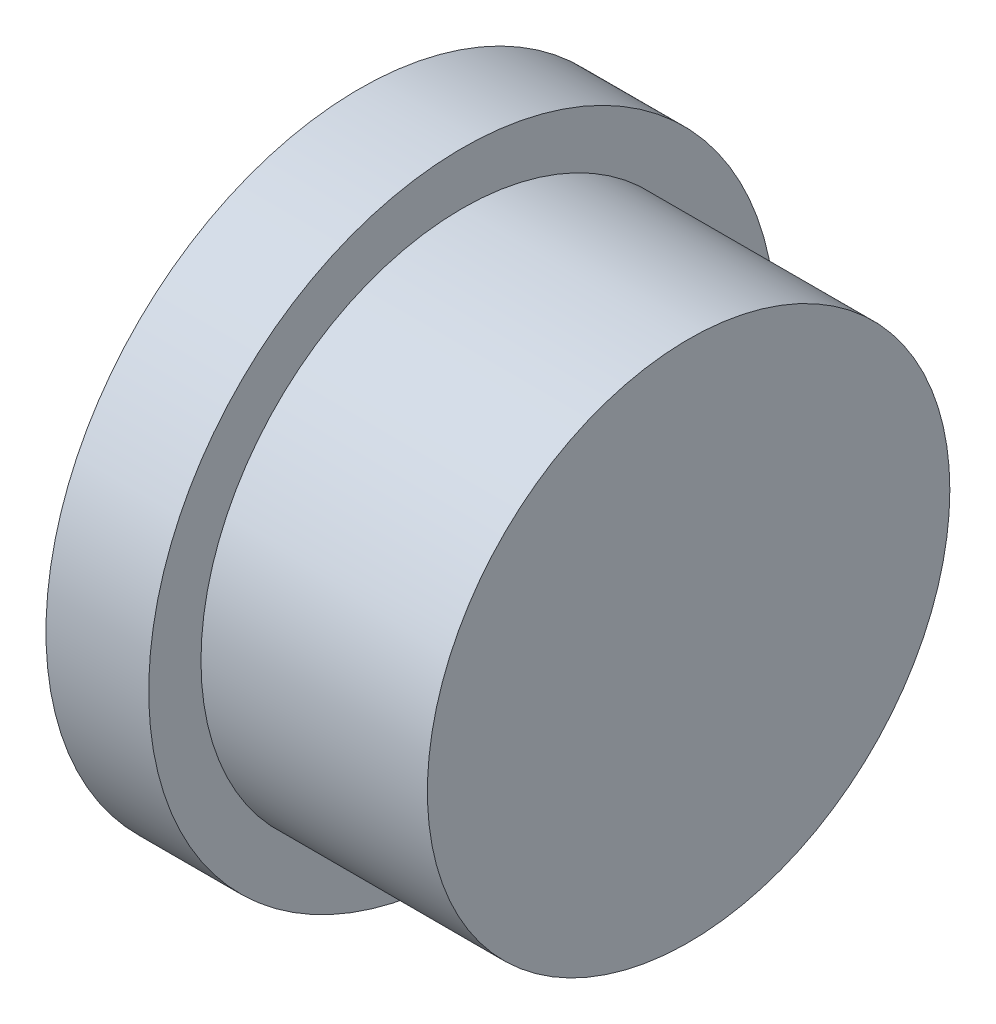
ISO-10303-21;
HEADER;
FILE_DESCRIPTION(('STEP AP214'),'2;1');
FILE_NAME('part.step','',(''),(''),'','','');
FILE_SCHEMA(('AUTOMOTIVE_DESIGN { 1 0 10303 214 1 1 1 1 }'));
ENDSEC;
DATA;
#1=APPLICATION_CONTEXT('core data for automotive mechanical design processes');
#2=APPLICATION_PROTOCOL_DEFINITION('international standard','automotive_design',2000,#1);
#3=PRODUCT_CONTEXT('',#1,'mechanical');
#4=PRODUCT('Part','Part','',(#3));
#5=PRODUCT_RELATED_PRODUCT_CATEGORY('part','',(#4));
#6=PRODUCT_DEFINITION_FORMATION('','',#4);
#7=PRODUCT_DEFINITION_CONTEXT('part definition',#1,'design');
#8=PRODUCT_DEFINITION('design','',#6,#7);
#9=PRODUCT_DEFINITION_SHAPE('','',#8);
#10=(LENGTH_UNIT() NAMED_UNIT(*) SI_UNIT(.MILLI.,.METRE.));
#11=(NAMED_UNIT(*) PLANE_ANGLE_UNIT() SI_UNIT($,.RADIAN.));
#12=(NAMED_UNIT(*) SI_UNIT($,.STERADIAN.) SOLID_ANGLE_UNIT());
#13=UNCERTAINTY_MEASURE_WITH_UNIT(LENGTH_MEASURE(1.E-05),#10,'distance_accuracy_value','');
#14=(GEOMETRIC_REPRESENTATION_CONTEXT(3) GLOBAL_UNCERTAINTY_ASSIGNED_CONTEXT((#13)) GLOBAL_UNIT_ASSIGNED_CONTEXT((#10,
#11,#12)) REPRESENTATION_CONTEXT('',''));
#15=CARTESIAN_POINT('',(0.,0.,0.));
#16=DIRECTION('',(0.,0.,1.));
#17=DIRECTION('',(1.,0.,0.));
#18=AXIS2_PLACEMENT_3D('',#15,#16,#17);
#19=CARTESIAN_POINT('',(22.2992133415162,4.38962310495809,-8.29136190635743));
#20=DIRECTION('',(-1.,0.,0.));
#21=DIRECTION('',(0.,0.,1.));
#22=AXIS2_PLACEMENT_3D('',#19,#20,#21);
#23=PLANE('',#22);
#24=CARTESIAN_POINT('',(22.2992133415162,4.38962310495809,-8.29136190635743));
#25=DIRECTION('',(-1.,0.,0.));
#26=DIRECTION('',(0.,0.,1.));
#27=AXIS2_PLACEMENT_3D('',#24,#25,#26);
#28=CIRCLE('',#27,13.5);
#29=CARTESIAN_POINT('',(22.2992133415162,4.38962310495809,-21.7913619063574));
#30=VERTEX_POINT('',#29);
#31=EDGE_CURVE('E55',#30,#30,#28,.T.);
#32=ORIENTED_EDGE('',*,*,#31,.F.);
#33=EDGE_LOOP('',(#32));
#34=FACE_BOUND('',#33,.T.);
#35=CARTESIAN_POINT('',(22.2992133415162,4.38962310495809,-8.29136190635743));
#36=DIRECTION('',(-1.,0.,0.));
#37=DIRECTION('',(0.,0.,1.));
#38=AXIS2_PLACEMENT_3D('',#35,#36,#37);
#39=CIRCLE('',#38,16.075);
#40=CARTESIAN_POINT('',(22.2992133415162,4.38962310495809,7.78363809364256));
#41=VERTEX_POINT('',#40);
#42=EDGE_CURVE('E62',#41,#41,#39,.T.);
#43=ORIENTED_EDGE('',*,*,#42,.T.);
#44=EDGE_LOOP('',(#43));
#45=FACE_BOUND('',#44,.T.);
#46=ADVANCED_FACE('F32',(#34,#45),#23,.T.);
#47=CARTESIAN_POINT('',(36.1992133415162,4.38962310495809,-8.29136190635743));
#48=DIRECTION('',(1.,0.,0.));
#49=DIRECTION('',(0.,0.,-1.));
#50=AXIS2_PLACEMENT_3D('',#47,#48,#49);
#51=PLANE('',#50);
#52=CARTESIAN_POINT('',(36.1992133415162,4.38962310495809,-8.29136190635743));
#53=DIRECTION('',(1.,0.,0.));
#54=DIRECTION('',(0.,0.,-1.));
#55=AXIS2_PLACEMENT_3D('',#52,#53,#54);
#56=CIRCLE('',#55,2.874);
#57=CARTESIAN_POINT('',(36.1992133415162,4.38962310495809,-11.1653619063574));
#58=VERTEX_POINT('',#57);
#59=EDGE_CURVE('E10',#58,#58,#56,.F.);
#60=ORIENTED_EDGE('',*,*,#59,.F.);
#61=EDGE_LOOP('',(#60));
#62=FACE_BOUND('',#61,.T.);
#63=CARTESIAN_POINT('',(36.1992133415162,4.38962310495809,-8.29136190635743));
#64=DIRECTION('',(1.,0.,0.));
#65=DIRECTION('',(0.,0.,-1.));
#66=AXIS2_PLACEMENT_3D('',#63,#64,#65);
#67=CIRCLE('',#66,13.5);
#68=CARTESIAN_POINT('',(36.1992133415162,4.38962310495809,-21.7913619063574));
#69=VERTEX_POINT('',#68);
#70=EDGE_CURVE('E43',#69,#69,#67,.F.);
#71=ORIENTED_EDGE('',*,*,#70,.T.);
#72=EDGE_LOOP('',(#71));
#73=FACE_BOUND('',#72,.T.);
#74=ADVANCED_FACE('F87',(#62,#73),#51,.F.);
#75=CARTESIAN_POINT('',(24.1992133415162,4.38962310495809,-8.29136190635743));
#76=DIRECTION('',(1.,0.,0.));
#77=DIRECTION('',(0.,0.,-1.));
#78=AXIS2_PLACEMENT_3D('',#75,#76,#77);
#79=CYLINDRICAL_SURFACE('',#78,13.5);
#80=CARTESIAN_POINT('',(36.1992133415162,4.38962310495809,-21.7913619063574));
#81=CARTESIAN_POINT('',(36.0544216748495,4.38962310495809,-21.7913619063574));
#82=CARTESIAN_POINT('',(35.9096300081828,4.38962310495809,-21.7913619063574));
#83=CARTESIAN_POINT('',(35.6200466748495,4.38962310495809,-21.7913619063574));
#84=CARTESIAN_POINT('',(35.4752550081828,4.38962310495809,-21.7913619063574));
#85=CARTESIAN_POINT('',(35.1856716748495,4.38962310495809,-21.7913619063574));
#86=CARTESIAN_POINT('',(35.0408800081828,4.38962310495809,-21.7913619063574));
#87=CARTESIAN_POINT('',(34.7512966748495,4.38962310495809,-21.7913619063574));
#88=CARTESIAN_POINT('',(34.6065050081828,4.38962310495809,-21.7913619063574));
#89=CARTESIAN_POINT('',(34.3169216748495,4.38962310495809,-21.7913619063574));
#90=CARTESIAN_POINT('',(34.1721300081828,4.38962310495809,-21.7913619063574));
#91=CARTESIAN_POINT('',(33.8825466748495,4.38962310495809,-21.7913619063574));
#92=CARTESIAN_POINT('',(33.7377550081828,4.38962310495809,-21.7913619063574));
#93=CARTESIAN_POINT('',(33.4481716748495,4.38962310495809,-21.7913619063574));
#94=CARTESIAN_POINT('',(33.3033800081828,4.38962310495809,-21.7913619063574));
#95=CARTESIAN_POINT('',(33.0137966748495,4.38962310495809,-21.7913619063574));
#96=CARTESIAN_POINT('',(32.8690050081828,4.38962310495809,-21.7913619063574));
#97=CARTESIAN_POINT('',(32.5794216748495,4.38962310495809,-21.7913619063574));
#98=CARTESIAN_POINT('',(32.4346300081828,4.38962310495809,-21.7913619063574));
#99=CARTESIAN_POINT('',(32.1450466748495,4.38962310495809,-21.7913619063574));
#100=CARTESIAN_POINT('',(32.0002550081828,4.38962310495809,-21.7913619063574));
#101=CARTESIAN_POINT('',(31.7106716748495,4.38962310495809,-21.7913619063574));
#102=CARTESIAN_POINT('',(31.5658800081828,4.38962310495809,-21.7913619063574));
#103=CARTESIAN_POINT('',(31.2762966748495,4.38962310495809,-21.7913619063574));
#104=CARTESIAN_POINT('',(31.1315050081828,4.38962310495809,-21.7913619063574));
#105=CARTESIAN_POINT('',(30.8419216748495,4.38962310495809,-21.7913619063574));
#106=CARTESIAN_POINT('',(30.6971300081828,4.38962310495809,-21.7913619063574));
#107=CARTESIAN_POINT('',(30.4075466748495,4.38962310495809,-21.7913619063574));
#108=CARTESIAN_POINT('',(30.2627550081828,4.38962310495809,-21.7913619063574));
#109=CARTESIAN_POINT('',(29.9731716748495,4.38962310495809,-21.7913619063574));
#110=CARTESIAN_POINT('',(29.8283800081828,4.38962310495809,-21.7913619063574));
#111=CARTESIAN_POINT('',(29.5387966748495,4.38962310495809,-21.7913619063574));
#112=CARTESIAN_POINT('',(29.3940050081828,4.38962310495809,-21.7913619063574));
#113=CARTESIAN_POINT('',(29.1044216748495,4.38962310495809,-21.7913619063574));
#114=CARTESIAN_POINT('',(28.9596300081828,4.38962310495809,-21.7913619063574));
#115=CARTESIAN_POINT('',(28.6700466748495,4.38962310495809,-21.7913619063574));
#116=CARTESIAN_POINT('',(28.5252550081828,4.38962310495809,-21.7913619063574));
#117=CARTESIAN_POINT('',(28.2356716748495,4.38962310495809,-21.7913619063574));
#118=CARTESIAN_POINT('',(28.0908800081828,4.38962310495809,-21.7913619063574));
#119=CARTESIAN_POINT('',(27.8012966748495,4.38962310495809,-21.7913619063574));
#120=CARTESIAN_POINT('',(27.6565050081828,4.38962310495809,-21.7913619063574));
#121=CARTESIAN_POINT('',(27.3669216748495,4.38962310495809,-21.7913619063574));
#122=CARTESIAN_POINT('',(27.2221300081828,4.38962310495809,-21.7913619063574));
#123=CARTESIAN_POINT('',(26.9325466748495,4.38962310495809,-21.7913619063574));
#124=CARTESIAN_POINT('',(26.7877550081828,4.38962310495809,-21.7913619063574));
#125=CARTESIAN_POINT('',(26.4981716748495,4.38962310495809,-21.7913619063574));
#126=CARTESIAN_POINT('',(26.3533800081828,4.38962310495809,-21.7913619063574));
#127=CARTESIAN_POINT('',(26.0637966748495,4.38962310495809,-21.7913619063574));
#128=CARTESIAN_POINT('',(25.9190050081828,4.38962310495809,-21.7913619063574));
#129=CARTESIAN_POINT('',(25.6294216748495,4.38962310495809,-21.7913619063574));
#130=CARTESIAN_POINT('',(25.4846300081828,4.38962310495809,-21.7913619063574));
#131=CARTESIAN_POINT('',(25.1950466748495,4.38962310495809,-21.7913619063574));
#132=CARTESIAN_POINT('',(25.0502550081828,4.38962310495809,-21.7913619063574));
#133=CARTESIAN_POINT('',(24.7606716748495,4.38962310495809,-21.7913619063574));
#134=CARTESIAN_POINT('',(24.6158800081828,4.38962310495809,-21.7913619063574));
#135=CARTESIAN_POINT('',(24.3262966748495,4.38962310495809,-21.7913619063574));
#136=CARTESIAN_POINT('',(24.1815050081828,4.38962310495809,-21.7913619063574));
#137=CARTESIAN_POINT('',(23.8919216748495,4.38962310495809,-21.7913619063574));
#138=CARTESIAN_POINT('',(23.7471300081828,4.38962310495809,-21.7913619063574));
#139=CARTESIAN_POINT('',(23.4575466748495,4.38962310495809,-21.7913619063574));
#140=CARTESIAN_POINT('',(23.3127550081828,4.38962310495809,-21.7913619063574));
#141=CARTESIAN_POINT('',(23.0231716748495,4.38962310495809,-21.7913619063574));
#142=CARTESIAN_POINT('',(22.8783800081828,4.38962310495809,-21.7913619063574));
#143=CARTESIAN_POINT('',(22.5887966748495,4.38962310495809,-21.7913619063574));
#144=CARTESIAN_POINT('',(22.4440050081828,4.38962310495809,-21.7913619063574));
#145=CARTESIAN_POINT('',(22.2992133415162,4.38962310495809,-21.7913619063574));
#146=B_SPLINE_CURVE_WITH_KNOTS('',3,(#80,#81,#82,#83,#84,#85,#86,#87,#88,#89,#90,#91,#92,#93,
#94,#95,#96,#97,#98,#99,#100,#101,#102,#103,#104,#105,#106,#107,#108,#109,#110,#111,#112,#113,
#114,#115,#116,#117,#118,#119,#120,#121,#122,#123,#124,#125,#126,#127,#128,#129,#130,#131,#132,
#133,#134,#135,#136,#137,#138,#139,#140,#141,#142,#143,#144,#145),.UNSPECIFIED.,.F.,.F.,(4,2,2,
2,2,2,2,2,2,2,2,2,2,2,2,2,2,2,2,2,2,2,2,2,2,2,2,2,2,2,2,2,4),(0.,0.434375000000001,
0.868750000000001,1.303125,1.7375,2.171875,2.60625,3.040625,3.475,3.909375,4.34375,4.778125,
5.2125,5.646875,6.08125,6.515625,6.95,7.384375,7.81875,8.253125,8.6875,9.121875,9.55625,
9.990625,10.425,10.859375,11.29375,11.728125,12.1625,12.596875,13.03125,13.465625,13.9),.UNSPECIFIED.);
#147=EDGE_CURVE('BSEAM93',#69,#30,#146,.T.);
#148=ORIENTED_EDGE('',*,*,#70,.F.);
#149=ORIENTED_EDGE('',*,*,#31,.T.);
#150=ORIENTED_EDGE('',*,*,#147,.T.);
#151=ORIENTED_EDGE('',*,*,#147,.F.);
#152=EDGE_LOOP('',(#148,#150,#149,#151));
#153=FACE_BOUND('',#152,.T.);
#154=ADVANCED_FACE('F93',(#153),#79,.F.);
#155=CARTESIAN_POINT('',(18.2992133415162,4.38962310495809,-8.29136190635743));
#156=DIRECTION('',(-1.,0.,0.));
#157=DIRECTION('',(0.,0.,1.));
#158=AXIS2_PLACEMENT_3D('',#155,#156,#157);
#159=PLANE('',#158);
#160=CARTESIAN_POINT('',(18.2992133415162,4.38962310495809,-8.29136190635743));
#161=DIRECTION('',(-1.,0.,0.));
#162=DIRECTION('',(0.,0.,1.));
#163=AXIS2_PLACEMENT_3D('',#160,#161,#162);
#164=CIRCLE('',#163,18.);
#165=CARTESIAN_POINT('',(18.2992133415162,4.38962310495809,-26.2913619063574));
#166=VERTEX_POINT('',#165);
#167=EDGE_CURVE('E58',#166,#166,#164,.T.);
#168=ORIENTED_EDGE('',*,*,#167,.T.);
#169=EDGE_LOOP('',(#168));
#170=FACE_BOUND('',#169,.T.);
#171=CARTESIAN_POINT('',(18.2992133415162,4.38962310495809,-8.29136190635743));
#172=DIRECTION('',(-1.,0.,0.));
#173=DIRECTION('',(0.,0.,1.));
#174=AXIS2_PLACEMENT_3D('',#171,#172,#173);
#175=CIRCLE('',#174,16.075);
#176=CARTESIAN_POINT('',(18.2992133415162,4.38962310495809,7.78363809364256));
#177=VERTEX_POINT('',#176);
#178=EDGE_CURVE('E61',#177,#177,#175,.T.);
#179=ORIENTED_EDGE('',*,*,#178,.F.);
#180=EDGE_LOOP('',(#179));
#181=FACE_BOUND('',#180,.T.);
#182=ADVANCED_FACE('F100',(#170,#181),#159,.T.);
#183=CARTESIAN_POINT('',(18.2992133415162,4.38962310495809,-8.29136190635743));
#184=DIRECTION('',(1.,0.,0.));
#185=DIRECTION('',(0.,0.,-1.));
#186=AXIS2_PLACEMENT_3D('',#183,#184,#185);
#187=CYLINDRICAL_SURFACE('',#186,16.075);
#188=ORIENTED_EDGE('',*,*,#178,.T.);
#189=EDGE_LOOP('',(#188));
#190=FACE_BOUND('',#189,.T.);
#191=ORIENTED_EDGE('',*,*,#42,.F.);
#192=EDGE_LOOP('',(#191));
#193=FACE_BOUND('',#192,.T.);
#194=ADVANCED_FACE('F112',(#190,#193),#187,.F.);
#195=CARTESIAN_POINT('',(37.1992133415162,4.38962310495809,-8.29136190635743));
#196=DIRECTION('',(1.,0.,0.));
#197=DIRECTION('',(0.,0.,-1.));
#198=AXIS2_PLACEMENT_3D('',#195,#196,#197);
#199=PLANE('',#198);
#200=CARTESIAN_POINT('',(37.1992133415162,4.38962310495809,-8.29136190635743));
#201=DIRECTION('',(1.,0.,0.));
#202=DIRECTION('',(0.,0.,-1.));
#203=AXIS2_PLACEMENT_3D('',#200,#201,#202);
#204=CIRCLE('',#203,15.);
#205=CARTESIAN_POINT('',(37.1992133415162,4.38962310495809,-23.2913619063574));
#206=VERTEX_POINT('',#205);
#207=EDGE_CURVE('E39',#206,#206,#204,.T.);
#208=ORIENTED_EDGE('',*,*,#207,.T.);
#209=EDGE_LOOP('',(#208));
#210=FACE_BOUND('',#209,.T.);
#211=ADVANCED_FACE('F34',(#210),#199,.T.);
#212=CARTESIAN_POINT('',(36.1992133415162,4.38962310495809,-8.29136190635743));
#213=DIRECTION('',(1.,0.,0.));
#214=DIRECTION('',(0.,0.,-1.));
#215=AXIS2_PLACEMENT_3D('',#212,#213,#214);
#216=CYLINDRICAL_SURFACE('',#215,15.);
#217=ORIENTED_EDGE('',*,*,#207,.F.);
#218=EDGE_LOOP('',(#217));
#219=FACE_BOUND('',#218,.T.);
#220=CARTESIAN_POINT('',(24.1992133415162,4.38962310495809,-8.29136190635743));
#221=DIRECTION('',(-1.,0.,0.));
#222=DIRECTION('',(0.,0.,1.));
#223=AXIS2_PLACEMENT_3D('',#220,#221,#222);
#224=CIRCLE('',#223,15.);
#225=CARTESIAN_POINT('',(24.1992133415162,4.38962310495809,6.70863809364257));
#226=VERTEX_POINT('',#225);
#227=EDGE_CURVE('E47',#226,#226,#224,.T.);
#228=ORIENTED_EDGE('',*,*,#227,.F.);
#229=EDGE_LOOP('',(#228));
#230=FACE_BOUND('',#229,.T.);
#231=ADVANCED_FACE('F102',(#219,#230),#216,.T.);
#232=CARTESIAN_POINT('',(24.1992133415162,4.38962310495809,-8.29136190635743));
#233=DIRECTION('',(-1.,0.,0.));
#234=DIRECTION('',(0.,0.,1.));
#235=AXIS2_PLACEMENT_3D('',#232,#233,#234);
#236=PLANE('',#235);
#237=ORIENTED_EDGE('',*,*,#227,.T.);
#238=EDGE_LOOP('',(#237));
#239=FACE_BOUND('',#238,.T.);
#240=CARTESIAN_POINT('',(24.1992133415162,4.38962310495809,-8.29136190635743));
#241=DIRECTION('',(-1.,0.,0.));
#242=DIRECTION('',(0.,0.,1.));
#243=AXIS2_PLACEMENT_3D('',#240,#241,#242);
#244=CIRCLE('',#243,18.);
#245=CARTESIAN_POINT('',(24.1992133415162,4.38962310495809,-26.2913619063574));
#246=VERTEX_POINT('',#245);
#247=EDGE_CURVE('E52',#246,#246,#244,.T.);
#248=ORIENTED_EDGE('',*,*,#247,.F.);
#249=EDGE_LOOP('',(#248));
#250=FACE_BOUND('',#249,.T.);
#251=ADVANCED_FACE('F82',(#239,#250),#236,.F.);
#252=CARTESIAN_POINT('',(22.2992133415162,4.38962310495809,-8.29136190635743));
#253=DIRECTION('',(1.,0.,0.));
#254=DIRECTION('',(0.,0.,-1.));
#255=AXIS2_PLACEMENT_3D('',#252,#253,#254);
#256=CYLINDRICAL_SURFACE('',#255,18.);
#257=CARTESIAN_POINT('',(24.1992133415162,4.38962310495809,-26.2913619063574));
#258=CARTESIAN_POINT('',(24.1377550081828,4.38962310495809,-26.2913619063574));
#259=CARTESIAN_POINT('',(24.0762966748495,4.38962310495809,-26.2913619063574));
#260=CARTESIAN_POINT('',(23.9533800081828,4.38962310495809,-26.2913619063574));
#261=CARTESIAN_POINT('',(23.8919216748495,4.38962310495809,-26.2913619063574));
#262=CARTESIAN_POINT('',(23.7690050081828,4.38962310495809,-26.2913619063574));
#263=CARTESIAN_POINT('',(23.7075466748495,4.38962310495809,-26.2913619063574));
#264=CARTESIAN_POINT('',(23.5846300081828,4.38962310495809,-26.2913619063574));
#265=CARTESIAN_POINT('',(23.5231716748495,4.38962310495809,-26.2913619063574));
#266=CARTESIAN_POINT('',(23.4002550081828,4.38962310495809,-26.2913619063574));
#267=CARTESIAN_POINT('',(23.3387966748495,4.38962310495809,-26.2913619063574));
#268=CARTESIAN_POINT('',(23.2158800081828,4.38962310495809,-26.2913619063574));
#269=CARTESIAN_POINT('',(23.1544216748495,4.38962310495809,-26.2913619063574));
#270=CARTESIAN_POINT('',(23.0315050081828,4.38962310495809,-26.2913619063574));
#271=CARTESIAN_POINT('',(22.9700466748495,4.38962310495809,-26.2913619063574));
#272=CARTESIAN_POINT('',(22.8471300081828,4.38962310495809,-26.2913619063574));
#273=CARTESIAN_POINT('',(22.7856716748495,4.38962310495809,-26.2913619063574));
#274=CARTESIAN_POINT('',(22.6627550081828,4.38962310495809,-26.2913619063574));
#275=CARTESIAN_POINT('',(22.6012966748495,4.38962310495809,-26.2913619063574));
#276=CARTESIAN_POINT('',(22.4783800081828,4.38962310495809,-26.2913619063574));
#277=CARTESIAN_POINT('',(22.4169216748495,4.38962310495809,-26.2913619063574));
#278=CARTESIAN_POINT('',(22.2940050081828,4.38962310495809,-26.2913619063574));
#279=CARTESIAN_POINT('',(22.2325466748495,4.38962310495809,-26.2913619063574));
#280=CARTESIAN_POINT('',(22.1096300081828,4.38962310495809,-26.2913619063574));
#281=CARTESIAN_POINT('',(22.0481716748495,4.38962310495809,-26.2913619063574));
#282=CARTESIAN_POINT('',(21.9252550081828,4.38962310495809,-26.2913619063574));
#283=CARTESIAN_POINT('',(21.8637966748495,4.38962310495809,-26.2913619063574));
#284=CARTESIAN_POINT('',(21.7408800081828,4.38962310495809,-26.2913619063574));
#285=CARTESIAN_POINT('',(21.6794216748495,4.38962310495809,-26.2913619063574));
#286=CARTESIAN_POINT('',(21.5565050081828,4.38962310495809,-26.2913619063574));
#287=CARTESIAN_POINT('',(21.4950466748495,4.38962310495809,-26.2913619063574));
#288=CARTESIAN_POINT('',(21.3721300081828,4.38962310495809,-26.2913619063574));
#289=CARTESIAN_POINT('',(21.3106716748495,4.38962310495809,-26.2913619063574));
#290=CARTESIAN_POINT('',(21.1877550081828,4.38962310495809,-26.2913619063574));
#291=CARTESIAN_POINT('',(21.1262966748495,4.38962310495809,-26.2913619063574));
#292=CARTESIAN_POINT('',(21.0033800081828,4.38962310495809,-26.2913619063574));
#293=CARTESIAN_POINT('',(20.9419216748495,4.38962310495809,-26.2913619063574));
#294=CARTESIAN_POINT('',(20.8190050081828,4.38962310495809,-26.2913619063574));
#295=CARTESIAN_POINT('',(20.7575466748495,4.38962310495809,-26.2913619063574));
#296=CARTESIAN_POINT('',(20.6346300081828,4.38962310495809,-26.2913619063574));
#297=CARTESIAN_POINT('',(20.5731716748495,4.38962310495809,-26.2913619063574));
#298=CARTESIAN_POINT('',(20.4502550081828,4.38962310495809,-26.2913619063574));
#299=CARTESIAN_POINT('',(20.3887966748495,4.38962310495809,-26.2913619063574));
#300=CARTESIAN_POINT('',(20.2658800081828,4.38962310495809,-26.2913619063574));
#301=CARTESIAN_POINT('',(20.2044216748495,4.38962310495809,-26.2913619063574));
#302=CARTESIAN_POINT('',(20.0815050081828,4.38962310495809,-26.2913619063574));
#303=CARTESIAN_POINT('',(20.0200466748495,4.38962310495809,-26.2913619063574));
#304=CARTESIAN_POINT('',(19.8971300081828,4.38962310495809,-26.2913619063574));
#305=CARTESIAN_POINT('',(19.8356716748495,4.38962310495809,-26.2913619063574));
#306=CARTESIAN_POINT('',(19.7127550081828,4.38962310495809,-26.2913619063574));
#307=CARTESIAN_POINT('',(19.6512966748495,4.38962310495809,-26.2913619063574));
#308=CARTESIAN_POINT('',(19.5283800081828,4.38962310495809,-26.2913619063574));
#309=CARTESIAN_POINT('',(19.4669216748495,4.38962310495809,-26.2913619063574));
#310=CARTESIAN_POINT('',(19.3440050081828,4.38962310495809,-26.2913619063574));
#311=CARTESIAN_POINT('',(19.2825466748495,4.38962310495809,-26.2913619063574));
#312=CARTESIAN_POINT('',(19.1596300081828,4.38962310495809,-26.2913619063574));
#313=CARTESIAN_POINT('',(19.0981716748495,4.38962310495809,-26.2913619063574));
#314=CARTESIAN_POINT('',(18.9752550081828,4.38962310495809,-26.2913619063574));
#315=CARTESIAN_POINT('',(18.9137966748495,4.38962310495809,-26.2913619063574));
#316=CARTESIAN_POINT('',(18.7908800081828,4.38962310495809,-26.2913619063574));
#317=CARTESIAN_POINT('',(18.7294216748495,4.38962310495809,-26.2913619063574));
#318=CARTESIAN_POINT('',(18.6065050081828,4.38962310495809,-26.2913619063574));
#319=CARTESIAN_POINT('',(18.5450466748495,4.38962310495809,-26.2913619063574));
#320=CARTESIAN_POINT('',(18.4221300081828,4.38962310495809,-26.2913619063574));
#321=CARTESIAN_POINT('',(18.3606716748495,4.38962310495809,-26.2913619063574));
#322=CARTESIAN_POINT('',(18.2992133415162,4.38962310495809,-26.2913619063574));
#323=B_SPLINE_CURVE_WITH_KNOTS('',3,(#257,#258,#259,#260,#261,#262,#263,#264,#265,#266,#267,
#268,#269,#270,#271,#272,#273,#274,#275,#276,#277,#278,#279,#280,#281,#282,#283,#284,#285,#286,
#287,#288,#289,#290,#291,#292,#293,#294,#295,#296,#297,#298,#299,#300,#301,#302,#303,#304,#305,
#306,#307,#308,#309,#310,#311,#312,#313,#314,#315,#316,#317,#318,#319,#320,#321,#322),
.UNSPECIFIED.,.F.,.F.,(4,2,2,2,2,2,2,2,2,2,2,2,2,2,2,2,2,2,2,2,2,2,2,2,2,2,2,2,2,2,2,2,4),(0.,
0.184375000000001,0.368750000000001,0.553125000000002,0.737500000000002,0.921875000000003,
1.10625,1.290625,1.475,1.659375,1.84375,2.028125,2.2125,2.396875,2.58125,2.765625,2.95,3.134375,
3.31875,3.503125,3.6875,3.871875,4.05625,4.240625,4.425,4.609375,4.79375,4.978125,5.1625,
5.346875,5.53125,5.715625,5.9),.UNSPECIFIED.);
#324=EDGE_CURVE('BSEAM75',#246,#166,#323,.T.);
#325=ORIENTED_EDGE('',*,*,#247,.T.);
#326=ORIENTED_EDGE('',*,*,#167,.F.);
#327=ORIENTED_EDGE('',*,*,#324,.T.);
#328=ORIENTED_EDGE('',*,*,#324,.F.);
#329=EDGE_LOOP('',(#325,#327,#326,#328));
#330=FACE_BOUND('',#329,.T.);
#331=ADVANCED_FACE('F75',(#330),#256,.T.);
#332=CARTESIAN_POINT('',(26.1992133415162,4.38962310495809,-8.29136190635743));
#333=DIRECTION('',(1.,0.,0.));
#334=DIRECTION('',(0.,0.,-1.));
#335=AXIS2_PLACEMENT_3D('',#332,#333,#334);
#336=CYLINDRICAL_SURFACE('',#335,2.874);
#337=CARTESIAN_POINT('',(26.1992133415162,4.38962310495809,-8.29136190635743));
#338=DIRECTION('',(-1.,0.,0.));
#339=DIRECTION('',(0.,0.,1.));
#340=AXIS2_PLACEMENT_3D('',#337,#338,#339);
#341=CIRCLE('',#340,2.874);
#342=CARTESIAN_POINT('',(26.1992133415162,4.38962310495809,-5.41736190635743));
#343=VERTEX_POINT('',#342);
#344=EDGE_CURVE('E65',#343,#343,#341,.T.);
#345=ORIENTED_EDGE('',*,*,#344,.F.);
#346=EDGE_LOOP('',(#345));
#347=FACE_BOUND('',#346,.T.);
#348=ORIENTED_EDGE('',*,*,#59,.T.);
#349=EDGE_LOOP('',(#348));
#350=FACE_BOUND('',#349,.T.);
#351=ADVANCED_FACE('F73',(#347,#350),#336,.T.);
#352=CARTESIAN_POINT('',(26.1992133415162,4.38962310495809,-8.29136190635743));
#353=DIRECTION('',(-1.,0.,0.));
#354=DIRECTION('',(0.,0.,1.));
#355=AXIS2_PLACEMENT_3D('',#352,#353,#354);
#356=PLANE('',#355);
#357=ORIENTED_EDGE('',*,*,#344,.T.);
#358=EDGE_LOOP('',(#357));
#359=FACE_BOUND('',#358,.T.);
#360=ADVANCED_FACE('F71',(#359),#356,.T.);
#361=CLOSED_SHELL('',(#46,#74,#154,#182,#194,#211,#231,#251,#331,#351,#360));
#362=MANIFOLD_SOLID_BREP('B2',#361);
#363=ADVANCED_BREP_SHAPE_REPRESENTATION('',(#18,#362),#14);
#364=SHAPE_DEFINITION_REPRESENTATION(#9,#363);
ENDSEC;
END-ISO-10303-21;
